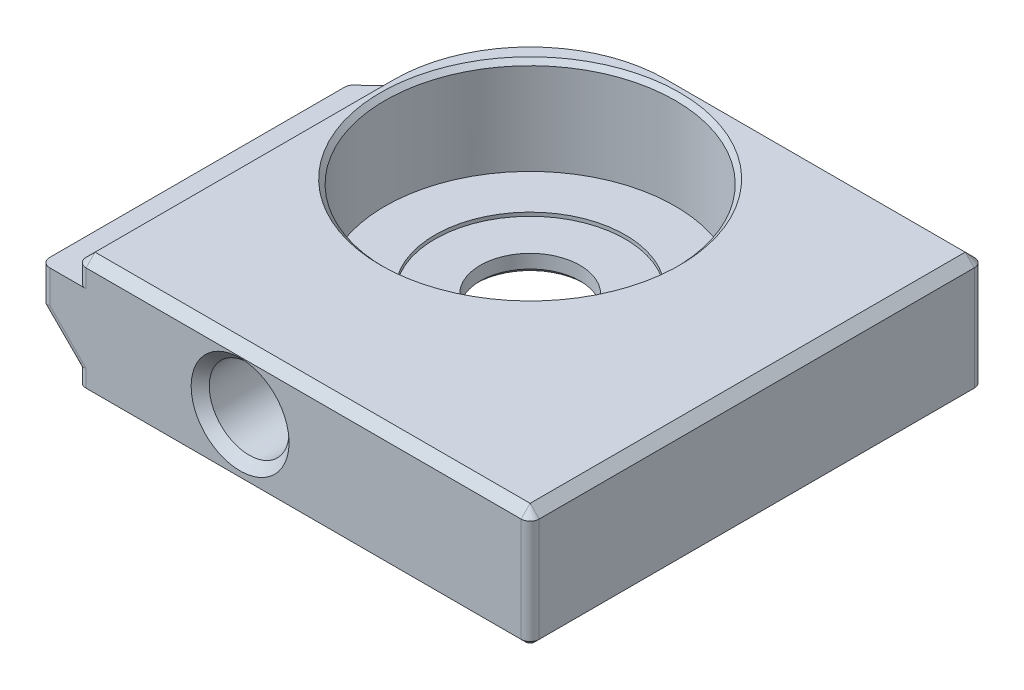
ISO-10303-21;
HEADER;
FILE_DESCRIPTION(('STEP AP214'),'2;1');
FILE_NAME('part.step','',(''),(''),'','','');
FILE_SCHEMA(('AUTOMOTIVE_DESIGN { 1 0 10303 214 1 1 1 1 }'));
ENDSEC;
DATA;
#1=APPLICATION_CONTEXT('core data for automotive mechanical design processes');
#2=APPLICATION_PROTOCOL_DEFINITION('international standard','automotive_design',2000,#1);
#3=PRODUCT_CONTEXT('',#1,'mechanical');
#4=PRODUCT('Part','Part','',(#3));
#5=PRODUCT_RELATED_PRODUCT_CATEGORY('part','',(#4));
#6=PRODUCT_DEFINITION_FORMATION('','',#4);
#7=PRODUCT_DEFINITION_CONTEXT('part definition',#1,'design');
#8=PRODUCT_DEFINITION('design','',#6,#7);
#9=PRODUCT_DEFINITION_SHAPE('','',#8);
#10=(LENGTH_UNIT() NAMED_UNIT(*) SI_UNIT(.MILLI.,.METRE.));
#11=(NAMED_UNIT(*) PLANE_ANGLE_UNIT() SI_UNIT($,.RADIAN.));
#12=(NAMED_UNIT(*) SI_UNIT($,.STERADIAN.) SOLID_ANGLE_UNIT());
#13=UNCERTAINTY_MEASURE_WITH_UNIT(LENGTH_MEASURE(1.E-05),#10,'distance_accuracy_value','');
#14=(GEOMETRIC_REPRESENTATION_CONTEXT(3) GLOBAL_UNCERTAINTY_ASSIGNED_CONTEXT((#13)) GLOBAL_UNIT_ASSIGNED_CONTEXT((#10,
#11,#12)) REPRESENTATION_CONTEXT('',''));
#15=CARTESIAN_POINT('',(0.,0.,0.));
#16=DIRECTION('',(0.,0.,1.));
#17=DIRECTION('',(1.,0.,0.));
#18=AXIS2_PLACEMENT_3D('',#15,#16,#17);
#19=CARTESIAN_POINT('',(-3.49999999999991,1.,-3.5));
#20=DIRECTION('',(0.,1.,0.));
#21=DIRECTION('',(0.,0.,1.));
#22=AXIS2_PLACEMENT_3D('',#19,#20,#21);
#23=PLANE('',#22);
#24=CARTESIAN_POINT('',(-3.49999999999991,1.,-3.5));
#25=DIRECTION('',(0.,1.,0.));
#26=DIRECTION('',(0.,0.,1.));
#27=AXIS2_PLACEMENT_3D('',#24,#25,#26);
#28=CIRCLE('',#27,2.75);
#29=CARTESIAN_POINT('',(-3.49999999999991,1.,-0.750000000000002));
#30=VERTEX_POINT('',#29);
#31=EDGE_CURVE('E50896',#30,#30,#28,.T.);
#32=ORIENTED_EDGE('',*,*,#31,.F.);
#33=EDGE_LOOP('',(#32));
#34=FACE_BOUND('',#33,.T.);
#35=CARTESIAN_POINT('',(-3.49999999999991,1.,-3.5));
#36=DIRECTION('',(0.,1.,0.));
#37=DIRECTION('',(0.,0.,1.));
#38=AXIS2_PLACEMENT_3D('',#35,#36,#37);
#39=CIRCLE('',#38,5.25);
#40=CARTESIAN_POINT('',(-3.49999999999991,1.,1.75));
#41=VERTEX_POINT('',#40);
#42=EDGE_CURVE('E50918',#41,#41,#39,.F.);
#43=ORIENTED_EDGE('',*,*,#42,.F.);
#44=EDGE_LOOP('',(#43));
#45=FACE_BOUND('',#44,.T.);
#46=ADVANCED_FACE('F50701',(#34,#45),#23,.T.);
#47=CARTESIAN_POINT('',(-12.5,6.5,12.5));
#48=DIRECTION('',(1.,0.,0.));
#49=DIRECTION('',(0.,0.,-1.));
#50=AXIS2_PLACEMENT_3D('',#47,#48,#49);
#51=PLANE('',#50);
#52=DIRECTION('',(0.,-1.,0.));
#53=VECTOR('',#52,1.);
#54=CARTESIAN_POINT('',(-12.5,6.5,-4.5));
#55=LINE('',#54,#53);
#56=CARTESIAN_POINT('',(-12.5,1.,-4.5));
#57=VERTEX_POINT('',#56);
#58=CARTESIAN_POINT('',(-12.5,0.249999999999997,-4.5));
#59=VERTEX_POINT('',#58);
#60=EDGE_CURVE('E50869',#57,#59,#55,.T.);
#61=ORIENTED_EDGE('',*,*,#60,.T.);
#62=DIRECTION('',(0.,0.,1.));
#63=VECTOR('',#62,1.);
#64=CARTESIAN_POINT('',(-12.5,0.249999999999997,12.));
#65=LINE('',#64,#63);
#66=CARTESIAN_POINT('',(-12.5,0.249999999999997,12.));
#67=VERTEX_POINT('',#66);
#68=EDGE_CURVE('E51057',#59,#67,#65,.T.);
#69=ORIENTED_EDGE('',*,*,#68,.T.);
#70=DIRECTION('',(0.,-1.,0.));
#71=VECTOR('',#70,1.);
#72=CARTESIAN_POINT('',(-12.5,6.5,12.));
#73=LINE('',#72,#71);
#74=CARTESIAN_POINT('',(-12.5,1.,12.));
#75=VERTEX_POINT('',#74);
#76=EDGE_CURVE('E50947',#67,#75,#73,.F.);
#77=ORIENTED_EDGE('',*,*,#76,.T.);
#78=DIRECTION('',(0.,0.,1.));
#79=VECTOR('',#78,1.);
#80=CARTESIAN_POINT('',(-12.5,1.,-4.5));
#81=LINE('',#80,#79);
#82=EDGE_CURVE('E50902',#57,#75,#81,.T.);
#83=ORIENTED_EDGE('',*,*,#82,.F.);
#84=EDGE_LOOP('',(#61,#69,#77,#83));
#85=FACE_BOUND('',#84,.T.);
#86=ADVANCED_FACE('F51159',(#85),#51,.F.);
#87=CARTESIAN_POINT('',(12.5,6.5,12.5));
#88=DIRECTION('',(-1.,0.,0.));
#89=DIRECTION('',(0.,0.,1.));
#90=AXIS2_PLACEMENT_3D('',#87,#88,#89);
#91=PLANE('',#90);
#92=DIRECTION('',(0.,-1.,0.));
#93=VECTOR('',#92,1.);
#94=CARTESIAN_POINT('',(12.5,6.5,12.));
#95=LINE('',#94,#93);
#96=CARTESIAN_POINT('',(12.5,6.,12.));
#97=VERTEX_POINT('',#96);
#98=CARTESIAN_POINT('',(12.5,0.249999999999997,12.));
#99=VERTEX_POINT('',#98);
#100=EDGE_CURVE('E50953',#97,#99,#95,.T.);
#101=ORIENTED_EDGE('',*,*,#100,.T.);
#102=DIRECTION('',(0.,0.,-1.));
#103=VECTOR('',#102,1.);
#104=CARTESIAN_POINT('',(12.5,0.249999999999997,-12.));
#105=LINE('',#104,#103);
#106=CARTESIAN_POINT('',(12.5,0.249999999999997,-12.));
#107=VERTEX_POINT('',#106);
#108=EDGE_CURVE('E50726',#99,#107,#105,.T.);
#109=ORIENTED_EDGE('',*,*,#108,.T.);
#110=DIRECTION('',(0.,-1.,0.));
#111=VECTOR('',#110,1.);
#112=CARTESIAN_POINT('',(12.5,6.5,-12.));
#113=LINE('',#112,#111);
#114=CARTESIAN_POINT('',(12.5,6.,-12.));
#115=VERTEX_POINT('',#114);
#116=EDGE_CURVE('E50955',#107,#115,#113,.F.);
#117=ORIENTED_EDGE('',*,*,#116,.T.);
#118=DIRECTION('',(0.,0.,1.));
#119=VECTOR('',#118,1.);
#120=CARTESIAN_POINT('',(12.5,6.,12.5));
#121=LINE('',#120,#119);
#122=EDGE_CURVE('E50989',#115,#97,#121,.T.);
#123=ORIENTED_EDGE('',*,*,#122,.T.);
#124=EDGE_LOOP('',(#101,#109,#117,#123));
#125=FACE_BOUND('',#124,.T.);
#126=ADVANCED_FACE('F51137',(#125),#91,.F.);
#127=CARTESIAN_POINT('',(-12.5,6.5,-12.5));
#128=DIRECTION('',(0.,0.,1.));
#129=DIRECTION('',(1.,0.,0.));
#130=AXIS2_PLACEMENT_3D('',#127,#128,#129);
#131=PLANE('',#130);
#132=DIRECTION('',(0.,-1.,0.));
#133=VECTOR('',#132,1.);
#134=CARTESIAN_POINT('',(12.,6.5,-12.5));
#135=LINE('',#134,#133);
#136=CARTESIAN_POINT('',(12.,6.,-12.5));
#137=VERTEX_POINT('',#136);
#138=CARTESIAN_POINT('',(12.,0.249999999999997,-12.5));
#139=VERTEX_POINT('',#138);
#140=EDGE_CURVE('E50951',#137,#139,#135,.T.);
#141=ORIENTED_EDGE('',*,*,#140,.T.);
#142=DIRECTION('',(-1.,0.,0.));
#143=VECTOR('',#142,1.);
#144=CARTESIAN_POINT('',(-4.5,0.249999999999997,-12.5));
#145=LINE('',#144,#143);
#146=CARTESIAN_POINT('',(-4.5,0.249999999999997,-12.5));
#147=VERTEX_POINT('',#146);
#148=EDGE_CURVE('E12',#139,#147,#145,.T.);
#149=ORIENTED_EDGE('',*,*,#148,.T.);
#150=DIRECTION('',(0.,-1.,0.));
#151=VECTOR('',#150,1.);
#152=CARTESIAN_POINT('',(-4.5,6.5,-12.5));
#153=LINE('',#152,#151);
#154=CARTESIAN_POINT('',(-4.5,6.,-12.5));
#155=VERTEX_POINT('',#154);
#156=EDGE_CURVE('E50907',#147,#155,#153,.F.);
#157=ORIENTED_EDGE('',*,*,#156,.T.);
#158=DIRECTION('',(1.,0.,0.));
#159=VECTOR('',#158,1.);
#160=CARTESIAN_POINT('',(-12.5,6.,-12.5));
#161=LINE('',#160,#159);
#162=EDGE_CURVE('E50999',#155,#137,#161,.T.);
#163=ORIENTED_EDGE('',*,*,#162,.T.);
#164=EDGE_LOOP('',(#141,#149,#157,#163));
#165=FACE_BOUND('',#164,.T.);
#166=ADVANCED_FACE('F51099',(#165),#131,.F.);
#167=DIRECTION('',(0.,-1.,0.));
#168=VECTOR('',#167,1.);
#169=CARTESIAN_POINT('',(-12.5,6.5,12.));
#170=LINE('',#169,#168);
#171=CARTESIAN_POINT('',(-12.5,5.,12.));
#172=VERTEX_POINT('',#171);
#173=CARTESIAN_POINT('',(-12.5,6.,12.));
#174=VERTEX_POINT('',#173);
#175=EDGE_CURVE('E50949',#172,#174,#170,.F.);
#176=ORIENTED_EDGE('',*,*,#175,.T.);
#177=DIRECTION('',(0.,0.,-1.));
#178=VECTOR('',#177,1.);
#179=CARTESIAN_POINT('',(-12.5,6.,12.5));
#180=LINE('',#179,#178);
#181=CARTESIAN_POINT('',(-12.5,6.,-4.5));
#182=VERTEX_POINT('',#181);
#183=EDGE_CURVE('E50864',#174,#182,#180,.T.);
#184=ORIENTED_EDGE('',*,*,#183,.T.);
#185=CARTESIAN_POINT('',(-12.5,5.,-4.5));
#186=VERTEX_POINT('',#185);
#187=EDGE_CURVE('E50856',#182,#186,#55,.T.);
#188=ORIENTED_EDGE('',*,*,#187,.T.);
#189=DIRECTION('',(0.,0.,1.));
#190=VECTOR('',#189,1.);
#191=CARTESIAN_POINT('',(-12.5,5.,-4.5));
#192=LINE('',#191,#190);
#193=EDGE_CURVE('E50861',#186,#172,#192,.T.);
#194=ORIENTED_EDGE('',*,*,#193,.T.);
#195=EDGE_LOOP('',(#176,#184,#188,#194));
#196=FACE_BOUND('',#195,.T.);
#197=ADVANCED_FACE('F50859',(#196),#51,.F.);
#198=CARTESIAN_POINT('',(-12.5,6.5,12.5));
#199=DIRECTION('',(0.,0.,-1.));
#200=DIRECTION('',(-1.,0.,0.));
#201=AXIS2_PLACEMENT_3D('',#198,#199,#200);
#202=PLANE('',#201);
#203=CARTESIAN_POINT('',(-3.5,3.25,12.5));
#204=DIRECTION('',(0.,0.,-1.));
#205=DIRECTION('',(-1.,0.,0.));
#206=AXIS2_PLACEMENT_3D('',#203,#204,#205);
#207=CIRCLE('',#206,2.70000000000001);
#208=CARTESIAN_POINT('',(-6.20000000000001,3.25,12.5));
#209=VERTEX_POINT('',#208);
#210=EDGE_CURVE('E50973',#209,#209,#207,.T.);
#211=ORIENTED_EDGE('',*,*,#210,.T.);
#212=EDGE_LOOP('',(#211));
#213=FACE_BOUND('',#212,.T.);
#214=DIRECTION('',(0.,-1.,0.));
#215=VECTOR('',#214,1.);
#216=CARTESIAN_POINT('',(-12.,6.5,12.5));
#217=LINE('',#216,#215);
#218=CARTESIAN_POINT('',(-12.,1.20710678118655,12.5));
#219=VERTEX_POINT('',#218);
#220=CARTESIAN_POINT('',(-12.,0.249999999999997,12.5));
#221=VERTEX_POINT('',#220);
#222=EDGE_CURVE('E50944',#219,#221,#217,.T.);
#223=ORIENTED_EDGE('',*,*,#222,.T.);
#224=DIRECTION('',(1.,0.,0.));
#225=VECTOR('',#224,1.);
#226=CARTESIAN_POINT('',(12.,0.249999999999997,12.5));
#227=LINE('',#226,#225);
#228=CARTESIAN_POINT('',(12.,0.249999999999997,12.5));
#229=VERTEX_POINT('',#228);
#230=EDGE_CURVE('E51066',#221,#229,#227,.T.);
#231=ORIENTED_EDGE('',*,*,#230,.T.);
#232=DIRECTION('',(0.,-1.,0.));
#233=VECTOR('',#232,1.);
#234=CARTESIAN_POINT('',(12.,6.5,12.5));
#235=LINE('',#234,#233);
#236=CARTESIAN_POINT('',(12.,6.,12.5));
#237=VERTEX_POINT('',#236);
#238=EDGE_CURVE('E50936',#229,#237,#235,.F.);
#239=ORIENTED_EDGE('',*,*,#238,.T.);
#240=DIRECTION('',(-1.,0.,0.));
#241=VECTOR('',#240,1.);
#242=CARTESIAN_POINT('',(-12.5,6.,12.5));
#243=LINE('',#242,#241);
#244=CARTESIAN_POINT('',(-12.,6.,12.5));
#245=VERTEX_POINT('',#244);
#246=EDGE_CURVE('E50970',#237,#245,#243,.T.);
#247=ORIENTED_EDGE('',*,*,#246,.T.);
#248=DIRECTION('',(0.,-1.,0.));
#249=VECTOR('',#248,1.);
#250=CARTESIAN_POINT('',(-12.,6.5,12.5));
#251=LINE('',#250,#249);
#252=CARTESIAN_POINT('',(-12.,5.,12.5));
#253=VERTEX_POINT('',#252);
#254=EDGE_CURVE('E50938',#245,#253,#251,.T.);
#255=ORIENTED_EDGE('',*,*,#254,.T.);
#256=DIRECTION('',(-1.,0.,0.));
#257=VECTOR('',#256,1.);
#258=CARTESIAN_POINT('',(-14.5,5.,12.5));
#259=LINE('',#258,#257);
#260=CARTESIAN_POINT('',(-14.,5.,12.5));
#261=VERTEX_POINT('',#260);
#262=EDGE_CURVE('E50889',#253,#261,#259,.T.);
#263=ORIENTED_EDGE('',*,*,#262,.T.);
#264=DIRECTION('',(0.,-1.,0.));
#265=VECTOR('',#264,1.);
#266=CARTESIAN_POINT('',(-14.,3.00000000000002,12.5));
#267=LINE('',#266,#265);
#268=CARTESIAN_POINT('',(-14.,3.20710678118657,12.5));
#269=VERTEX_POINT('',#268);
#270=EDGE_CURVE('E50940',#261,#269,#267,.T.);
#271=ORIENTED_EDGE('',*,*,#270,.T.);
#272=DIRECTION('',(0.707106781186544,-0.707106781186551,0.));
#273=VECTOR('',#272,1.);
#274=CARTESIAN_POINT('',(-12.1464466094067,1.35355339059327,12.5));
#275=LINE('',#274,#273);
#276=EDGE_CURVE('E50942',#269,#219,#275,.T.);
#277=ORIENTED_EDGE('',*,*,#276,.T.);
#278=EDGE_LOOP('',(#223,#231,#239,#247,#255,#263,#271,#277));
#279=FACE_BOUND('',#278,.T.);
#280=ADVANCED_FACE('F51185',(#213,#279),#202,.F.);
#281=CARTESIAN_POINT('',(0.,6.5,0.));
#282=DIRECTION('',(0.,-1.,0.));
#283=DIRECTION('',(0.,0.,-1.));
#284=AXIS2_PLACEMENT_3D('',#281,#282,#283);
#285=PLANE('',#284);
#286=CARTESIAN_POINT('',(-3.49999999999991,6.5,-3.5));
#287=DIRECTION('',(0.,-1.,0.));
#288=DIRECTION('',(0.,0.,-1.));
#289=AXIS2_PLACEMENT_3D('',#286,#287,#288);
#290=CIRCLE('',#289,8.25);
#291=CARTESIAN_POINT('',(-3.49999999999991,6.5,-11.75));
#292=VERTEX_POINT('',#291);
#293=EDGE_CURVE('E51030',#292,#292,#290,.T.);
#294=ORIENTED_EDGE('',*,*,#293,.T.);
#295=EDGE_LOOP('',(#294));
#296=FACE_BOUND('',#295,.T.);
#297=DIRECTION('',(1.,0.,0.));
#298=VECTOR('',#297,1.);
#299=CARTESIAN_POINT('',(0.,6.5,12.));
#300=LINE('',#299,#298);
#301=CARTESIAN_POINT('',(-12.,6.5,12.));
#302=VERTEX_POINT('',#301);
#303=CARTESIAN_POINT('',(12.,6.5,12.));
#304=VERTEX_POINT('',#303);
#305=EDGE_CURVE('E50982',#302,#304,#300,.T.);
#306=ORIENTED_EDGE('',*,*,#305,.T.);
#307=DIRECTION('',(0.,0.,-1.));
#308=VECTOR('',#307,1.);
#309=CARTESIAN_POINT('',(12.,6.5,0.));
#310=LINE('',#309,#308);
#311=CARTESIAN_POINT('',(12.,6.5,-12.));
#312=VERTEX_POINT('',#311);
#313=EDGE_CURVE('E50985',#304,#312,#310,.T.);
#314=ORIENTED_EDGE('',*,*,#313,.T.);
#315=DIRECTION('',(-1.,0.,0.));
#316=VECTOR('',#315,1.);
#317=CARTESIAN_POINT('',(0.,6.5,-12.));
#318=LINE('',#317,#316);
#319=CARTESIAN_POINT('',(-4.5,6.5,-12.));
#320=VERTEX_POINT('',#319);
#321=EDGE_CURVE('E50980',#312,#320,#318,.T.);
#322=ORIENTED_EDGE('',*,*,#321,.T.);
#323=CARTESIAN_POINT('',(-4.5,6.5,-4.5));
#324=DIRECTION('',(0.,-1.,0.));
#325=DIRECTION('',(0.,0.,-1.));
#326=AXIS2_PLACEMENT_3D('',#323,#324,#325);
#327=CIRCLE('',#326,7.5);
#328=CARTESIAN_POINT('',(-12.,6.5,-4.5));
#329=VERTEX_POINT('',#328);
#330=EDGE_CURVE('E50978',#320,#329,#327,.F.);
#331=ORIENTED_EDGE('',*,*,#330,.T.);
#332=DIRECTION('',(0.,0.,1.));
#333=VECTOR('',#332,1.);
#334=CARTESIAN_POINT('',(-12.,6.5,0.));
#335=LINE('',#334,#333);
#336=EDGE_CURVE('E50976',#329,#302,#335,.T.);
#337=ORIENTED_EDGE('',*,*,#336,.T.);
#338=EDGE_LOOP('',(#306,#314,#322,#331,#337));
#339=FACE_BOUND('',#338,.T.);
#340=ADVANCED_FACE('F51123',(#296,#339),#285,.F.);
#341=CARTESIAN_POINT('',(0.,0.,0.));
#342=DIRECTION('',(0.,-1.,0.));
#343=DIRECTION('',(0.,0.,-1.));
#344=AXIS2_PLACEMENT_3D('',#341,#342,#343);
#345=PLANE('',#344);
#346=CARTESIAN_POINT('',(-3.49999999999991,0.,-3.5));
#347=DIRECTION('',(0.,-1.,0.));
#348=DIRECTION('',(0.,0.,-1.));
#349=AXIS2_PLACEMENT_3D('',#346,#347,#348);
#350=CIRCLE('',#349,2.99999999999999);
#351=CARTESIAN_POINT('',(-3.49999999999991,0.,-6.49999999999999));
#352=VERTEX_POINT('',#351);
#353=EDGE_CURVE('E51049',#352,#352,#350,.F.);
#354=ORIENTED_EDGE('',*,*,#353,.T.);
#355=EDGE_LOOP('',(#354));
#356=FACE_BOUND('',#355,.T.);
#357=CARTESIAN_POINT('',(-12.,0.,12.));
#358=DIRECTION('',(0.,-1.,0.));
#359=DIRECTION('',(0.,0.,-1.));
#360=AXIS2_PLACEMENT_3D('',#357,#358,#359);
#361=CIRCLE('',#360,0.25);
#362=CARTESIAN_POINT('',(-12.,0.,12.25));
#363=VERTEX_POINT('',#362);
#364=CARTESIAN_POINT('',(-12.25,0.,12.));
#365=VERTEX_POINT('',#364);
#366=EDGE_CURVE('E51045',#363,#365,#361,.T.);
#367=ORIENTED_EDGE('',*,*,#366,.T.);
#368=DIRECTION('',(0.,0.,-1.));
#369=VECTOR('',#368,1.);
#370=CARTESIAN_POINT('',(-12.25,0.,-4.5));
#371=LINE('',#370,#369);
#372=CARTESIAN_POINT('',(-12.25,0.,-6.48431348329845));
#373=VERTEX_POINT('',#372);
#374=EDGE_CURVE('E51047',#365,#373,#371,.T.);
#375=ORIENTED_EDGE('',*,*,#374,.T.);
#376=CARTESIAN_POINT('',(-4.5,0.,-4.5));
#377=DIRECTION('',(0.,-1.,0.));
#378=DIRECTION('',(0.,0.,-1.));
#379=AXIS2_PLACEMENT_3D('',#376,#377,#378);
#380=CIRCLE('',#379,8.);
#381=CARTESIAN_POINT('',(-6.48431348329843,0.,-12.25));
#382=VERTEX_POINT('',#381);
#383=EDGE_CURVE('E50868',#373,#382,#380,.T.);
#384=ORIENTED_EDGE('',*,*,#383,.T.);
#385=DIRECTION('',(1.,0.,0.));
#386=VECTOR('',#385,1.);
#387=CARTESIAN_POINT('',(12.,0.,-12.25));
#388=LINE('',#387,#386);
#389=CARTESIAN_POINT('',(12.,0.,-12.25));
#390=VERTEX_POINT('',#389);
#391=EDGE_CURVE('E51036',#382,#390,#388,.T.);
#392=ORIENTED_EDGE('',*,*,#391,.T.);
#393=CARTESIAN_POINT('',(12.,0.,-12.));
#394=DIRECTION('',(0.,-1.,0.));
#395=DIRECTION('',(0.,0.,-1.));
#396=AXIS2_PLACEMENT_3D('',#393,#394,#395);
#397=CIRCLE('',#396,0.25);
#398=CARTESIAN_POINT('',(12.25,0.,-12.));
#399=VERTEX_POINT('',#398);
#400=EDGE_CURVE('E51034',#390,#399,#397,.T.);
#401=ORIENTED_EDGE('',*,*,#400,.T.);
#402=DIRECTION('',(0.,0.,1.));
#403=VECTOR('',#402,1.);
#404=CARTESIAN_POINT('',(12.25,0.,12.));
#405=LINE('',#404,#403);
#406=CARTESIAN_POINT('',(12.25,0.,12.));
#407=VERTEX_POINT('',#406);
#408=EDGE_CURVE('E51038',#399,#407,#405,.T.);
#409=ORIENTED_EDGE('',*,*,#408,.T.);
#410=CARTESIAN_POINT('',(12.,0.,12.));
#411=DIRECTION('',(0.,-1.,0.));
#412=DIRECTION('',(0.,0.,-1.));
#413=AXIS2_PLACEMENT_3D('',#410,#411,#412);
#414=CIRCLE('',#413,0.25);
#415=CARTESIAN_POINT('',(12.,0.,12.25));
#416=VERTEX_POINT('',#415);
#417=EDGE_CURVE('E51040',#407,#416,#414,.T.);
#418=ORIENTED_EDGE('',*,*,#417,.T.);
#419=DIRECTION('',(-1.,0.,0.));
#420=VECTOR('',#419,1.);
#421=CARTESIAN_POINT('',(-12.,0.,12.25));
#422=LINE('',#421,#420);
#423=EDGE_CURVE('E51042',#416,#363,#422,.T.);
#424=ORIENTED_EDGE('',*,*,#423,.T.);
#425=EDGE_LOOP('',(#367,#375,#384,#392,#401,#409,#418,#424));
#426=FACE_BOUND('',#425,.T.);
#427=ADVANCED_FACE('F51146',(#356,#426),#345,.T.);
#428=CARTESIAN_POINT('',(-3.49999999999991,1.,-3.5));
#429=DIRECTION('',(0.,1.,0.));
#430=DIRECTION('',(0.,0.,1.));
#431=AXIS2_PLACEMENT_3D('',#428,#429,#430);
#432=CYLINDRICAL_SURFACE('',#431,8.00000000000001);
#433=CARTESIAN_POINT('',(-3.49999999999991,6.25000000000001,-3.5));
#434=DIRECTION('',(0.,-1.,0.));
#435=DIRECTION('',(0.,0.,-1.));
#436=AXIS2_PLACEMENT_3D('',#433,#434,#435);
#437=CIRCLE('',#436,8.00000000000001);
#438=CARTESIAN_POINT('',(-3.49999999999991,6.25000000000001,-11.5));
#439=VERTEX_POINT('',#438);
#440=EDGE_CURVE('E51006',#439,#439,#437,.F.);
#441=ORIENTED_EDGE('',*,*,#440,.T.);
#442=EDGE_LOOP('',(#441));
#443=FACE_BOUND('',#442,.T.);
#444=CARTESIAN_POINT('',(-3.49999999999991,1.2,-3.5));
#445=DIRECTION('',(0.,1.,0.));
#446=DIRECTION('',(0.,0.,1.));
#447=AXIS2_PLACEMENT_3D('',#444,#445,#446);
#448=CIRCLE('',#447,8.00000000000001);
#449=CARTESIAN_POINT('',(-3.49999999999991,1.2,4.50000000000001));
#450=VERTEX_POINT('',#449);
#451=EDGE_CURVE('E51640',#450,#450,#448,.T.);
#452=ORIENTED_EDGE('',*,*,#451,.F.);
#453=EDGE_LOOP('',(#452));
#454=FACE_BOUND('',#453,.T.);
#455=ADVANCED_FACE('F51220',(#443,#454),#432,.F.);
#456=CARTESIAN_POINT('',(-4.5,6.5,-4.5));
#457=DIRECTION('',(0.,-1.,0.));
#458=DIRECTION('',(0.,0.,-1.));
#459=AXIS2_PLACEMENT_3D('',#456,#457,#458);
#460=CYLINDRICAL_SURFACE('',#459,8.);
#461=ORIENTED_EDGE('',*,*,#383,.F.);
#462=CARTESIAN_POINT('',(-4.5,-7.74999999999989,-4.5));
#463=DIRECTION('',(-0.707106781186543,-0.707106781186552,0.));
#464=DIRECTION('',(0.707106781186552,-0.707106781186543,0.));
#465=AXIS2_PLACEMENT_3D('',#462,#463,#464);
#466=ELLIPSE('',#465,11.3137084989847,8.);
#467=EDGE_CURVE('E51062',#373,#59,#466,.F.);
#468=ORIENTED_EDGE('',*,*,#467,.T.);
#469=ORIENTED_EDGE('',*,*,#60,.F.);
#470=CARTESIAN_POINT('',(-4.5,-7.00000000000008,-4.5));
#471=DIRECTION('',(-0.707106781186551,-0.707106781186544,0.));
#472=DIRECTION('',(0.707106781186544,-0.707106781186551,0.));
#473=AXIS2_PLACEMENT_3D('',#470,#471,#472);
#474=ELLIPSE('',#473,11.3137084989848,8.);
#475=CARTESIAN_POINT('',(-11.7,0.199999999999995,-7.98711915483253));
#476=VERTEX_POINT('',#475);
#477=EDGE_CURVE('E50910',#57,#476,#474,.T.);
#478=ORIENTED_EDGE('',*,*,#477,.T.);
#479=DIRECTION('',(0.,-1.,0.));
#480=VECTOR('',#479,1.);
#481=CARTESIAN_POINT('',(-11.7,6.5,-7.98711915483253));
#482=LINE('',#481,#480);
#483=CARTESIAN_POINT('',(-11.7,5.,-7.98711915483253));
#484=VERTEX_POINT('',#483);
#485=EDGE_CURVE('E50878',#476,#484,#482,.F.);
#486=ORIENTED_EDGE('',*,*,#485,.T.);
#487=CARTESIAN_POINT('',(-4.5,5.,-4.5));
#488=DIRECTION('',(0.,1.,0.));
#489=DIRECTION('',(0.,0.,1.));
#490=AXIS2_PLACEMENT_3D('',#487,#488,#489);
#491=CIRCLE('',#490,8.);
#492=EDGE_CURVE('E50873',#484,#186,#491,.T.);
#493=ORIENTED_EDGE('',*,*,#492,.T.);
#494=ORIENTED_EDGE('',*,*,#187,.F.);
#495=CARTESIAN_POINT('',(-4.5,6.,-4.5));
#496=DIRECTION('',(0.,-1.,0.));
#497=DIRECTION('',(0.,0.,-1.));
#498=AXIS2_PLACEMENT_3D('',#495,#496,#497);
#499=CIRCLE('',#498,8.);
#500=EDGE_CURVE('E51001',#182,#155,#499,.T.);
#501=ORIENTED_EDGE('',*,*,#500,.T.);
#502=ORIENTED_EDGE('',*,*,#156,.F.);
#503=CARTESIAN_POINT('',(-4.5,-7.7499999999999,-4.5));
#504=DIRECTION('',(0.,-0.707106781186552,-0.707106781186543));
#505=DIRECTION('',(0.,-0.707106781186543,0.707106781186552));
#506=AXIS2_PLACEMENT_3D('',#503,#504,#505);
#507=ELLIPSE('',#506,11.3137084989847,8.);
#508=EDGE_CURVE('E51060',#147,#382,#507,.F.);
#509=ORIENTED_EDGE('',*,*,#508,.T.);
#510=EDGE_LOOP('',(#461,#468,#469,#478,#486,#493,#494,#501,#502,#509));
#511=FACE_BOUND('',#510,.T.);
#512=ADVANCED_FACE('F50875',(#511),#460,.T.);
#513=CARTESIAN_POINT('',(-3.5,3.25,5.));
#514=DIRECTION('',(0.,0.,1.));
#515=DIRECTION('',(1.,0.,0.));
#516=AXIS2_PLACEMENT_3D('',#513,#514,#515);
#517=CYLINDRICAL_SURFACE('',#516,2.2);
#518=CARTESIAN_POINT('',(-3.5,3.25,12.));
#519=DIRECTION('',(0.,0.,-1.));
#520=DIRECTION('',(-1.,0.,0.));
#521=AXIS2_PLACEMENT_3D('',#518,#519,#520);
#522=CIRCLE('',#521,2.2);
#523=CARTESIAN_POINT('',(-5.7,3.25,12.));
#524=VERTEX_POINT('',#523);
#525=EDGE_CURVE('E50958',#524,#524,#522,.F.);
#526=ORIENTED_EDGE('',*,*,#525,.T.);
#527=EDGE_LOOP('',(#526));
#528=FACE_BOUND('',#527,.T.);
#529=CARTESIAN_POINT('',(-3.5,3.25,5.));
#530=DIRECTION('',(0.,0.,1.));
#531=DIRECTION('',(1.,0.,0.));
#532=AXIS2_PLACEMENT_3D('',#529,#530,#531);
#533=CIRCLE('',#532,2.2);
#534=CARTESIAN_POINT('',(-1.3,3.25,5.));
#535=VERTEX_POINT('',#534);
#536=EDGE_CURVE('E50900',#535,#535,#533,.T.);
#537=ORIENTED_EDGE('',*,*,#536,.F.);
#538=EDGE_LOOP('',(#537));
#539=FACE_BOUND('',#538,.T.);
#540=ADVANCED_FACE('F51218',(#528,#539),#517,.F.);
#541=CARTESIAN_POINT('',(-3.5,3.25,5.));
#542=DIRECTION('',(0.,0.,1.));
#543=DIRECTION('',(1.,0.,0.));
#544=AXIS2_PLACEMENT_3D('',#541,#542,#543);
#545=PLANE('',#544);
#546=ORIENTED_EDGE('',*,*,#536,.T.);
#547=EDGE_LOOP('',(#546));
#548=FACE_BOUND('',#547,.T.);
#549=ADVANCED_FACE('F51559',(#548),#545,.T.);
#550=CARTESIAN_POINT('',(-12.5,1.,-4.5));
#551=DIRECTION('',(-0.707106781186551,-0.707106781186544,0.));
#552=DIRECTION('',(0.707106781186544,-0.707106781186551,0.));
#553=AXIS2_PLACEMENT_3D('',#550,#551,#552);
#554=PLANE('',#553);
#555=DIRECTION('',(0.,0.,1.));
#556=VECTOR('',#555,1.);
#557=CARTESIAN_POINT('',(-14.5,3.00000000000002,-4.5));
#558=LINE('',#557,#556);
#559=CARTESIAN_POINT('',(-14.5,3.00000000000002,-4.26146492581012));
#560=VERTEX_POINT('',#559);
#561=CARTESIAN_POINT('',(-14.5,3.00000000000002,12.));
#562=VERTEX_POINT('',#561);
#563=EDGE_CURVE('E50892',#560,#562,#558,.T.);
#564=ORIENTED_EDGE('',*,*,#563,.F.);
#565=CARTESIAN_POINT('',(-14.,2.50000000000002,-4.26146492581012));
#566=DIRECTION('',(-0.707106781186551,-0.707106781186544,0.));
#567=DIRECTION('',(0.707106781186544,-0.707106781186551,0.));
#568=AXIS2_PLACEMENT_3D('',#565,#566,#567);
#569=ELLIPSE('',#568,0.707106781186551,0.5);
#570=CARTESIAN_POINT('',(-14.3190476190476,2.81904761904764,-4.64644364831312));
#571=VERTEX_POINT('',#570);
#572=EDGE_CURVE('E50928',#560,#571,#569,.T.);
#573=ORIENTED_EDGE('',*,*,#572,.T.);
#574=CARTESIAN_POINT('',(-20.7,9.2000000000001,-12.3460180983732));
#575=DIRECTION('',(-0.707106781186551,-0.707106781186544,0.));
#576=DIRECTION('',(0.707106781186544,-0.707106781186551,0.));
#577=AXIS2_PLACEMENT_3D('',#574,#575,#576);
#578=ELLIPSE('',#577,14.142135623731,10.);
#579=EDGE_CURVE('E50916',#571,#476,#578,.F.);
#580=ORIENTED_EDGE('',*,*,#579,.T.);
#581=ORIENTED_EDGE('',*,*,#477,.F.);
#582=ORIENTED_EDGE('',*,*,#82,.T.);
#583=DIRECTION('',(0.707106781186544,-0.707106781186551,0.));
#584=VECTOR('',#583,1.);
#585=CARTESIAN_POINT('',(-14.5,3.00000000000002,12.));
#586=LINE('',#585,#584);
#587=EDGE_CURVE('E50926',#75,#562,#586,.F.);
#588=ORIENTED_EDGE('',*,*,#587,.T.);
#589=EDGE_LOOP('',(#564,#573,#580,#581,#582,#588));
#590=FACE_BOUND('',#589,.T.);
#591=ADVANCED_FACE('F51174',(#590),#554,.T.);
#592=CARTESIAN_POINT('',(-14.5,3.00000000000002,-4.5));
#593=DIRECTION('',(-1.,0.,0.));
#594=DIRECTION('',(0.,0.,1.));
#595=AXIS2_PLACEMENT_3D('',#592,#593,#594);
#596=PLANE('',#595);
#597=DIRECTION('',(0.,0.,1.));
#598=VECTOR('',#597,1.);
#599=CARTESIAN_POINT('',(-14.5,5.,-4.5));
#600=LINE('',#599,#598);
#601=CARTESIAN_POINT('',(-14.5,5.,-4.26146492581012));
#602=VERTEX_POINT('',#601);
#603=CARTESIAN_POINT('',(-14.5,5.,12.));
#604=VERTEX_POINT('',#603);
#605=EDGE_CURVE('E50888',#602,#604,#600,.T.);
#606=ORIENTED_EDGE('',*,*,#605,.F.);
#607=DIRECTION('',(0.,1.,0.));
#608=VECTOR('',#607,1.);
#609=CARTESIAN_POINT('',(-14.5,3.00000000000002,-4.26146492581012));
#610=LINE('',#609,#608);
#611=EDGE_CURVE('E50923',#602,#560,#610,.F.);
#612=ORIENTED_EDGE('',*,*,#611,.T.);
#613=ORIENTED_EDGE('',*,*,#563,.T.);
#614=DIRECTION('',(0.,-1.,0.));
#615=VECTOR('',#614,1.);
#616=CARTESIAN_POINT('',(-14.5,5.,12.));
#617=LINE('',#616,#615);
#618=EDGE_CURVE('E50921',#562,#604,#617,.F.);
#619=ORIENTED_EDGE('',*,*,#618,.T.);
#620=EDGE_LOOP('',(#606,#612,#613,#619));
#621=FACE_BOUND('',#620,.T.);
#622=ADVANCED_FACE('F51178',(#621),#596,.T.);
#623=CARTESIAN_POINT('',(-14.5,5.,-4.5));
#624=DIRECTION('',(0.,1.,0.));
#625=DIRECTION('',(0.,0.,1.));
#626=AXIS2_PLACEMENT_3D('',#623,#624,#625);
#627=PLANE('',#626);
#628=CARTESIAN_POINT('',(-20.7,5.,-12.3460180983732));
#629=DIRECTION('',(0.,1.,0.));
#630=DIRECTION('',(0.,0.,1.));
#631=AXIS2_PLACEMENT_3D('',#628,#629,#630);
#632=CIRCLE('',#631,10.);
#633=CARTESIAN_POINT('',(-14.3190476190476,5.,-4.64644364831312));
#634=VERTEX_POINT('',#633);
#635=EDGE_CURVE('E50882',#484,#634,#632,.F.);
#636=ORIENTED_EDGE('',*,*,#635,.T.);
#637=CARTESIAN_POINT('',(-14.,5.,-4.26146492581012));
#638=DIRECTION('',(0.,1.,0.));
#639=DIRECTION('',(0.,0.,1.));
#640=AXIS2_PLACEMENT_3D('',#637,#638,#639);
#641=CIRCLE('',#640,0.5);
#642=EDGE_CURVE('E50934',#634,#602,#641,.T.);
#643=ORIENTED_EDGE('',*,*,#642,.T.);
#644=ORIENTED_EDGE('',*,*,#605,.T.);
#645=CARTESIAN_POINT('',(-14.,5.,12.));
#646=DIRECTION('',(0.,1.,0.));
#647=DIRECTION('',(0.,0.,1.));
#648=AXIS2_PLACEMENT_3D('',#645,#646,#647);
#649=CIRCLE('',#648,0.5);
#650=EDGE_CURVE('E50932',#604,#261,#649,.T.);
#651=ORIENTED_EDGE('',*,*,#650,.T.);
#652=ORIENTED_EDGE('',*,*,#262,.F.);
#653=CARTESIAN_POINT('',(-12.,5.,12.));
#654=DIRECTION('',(0.,1.,0.));
#655=DIRECTION('',(0.,0.,1.));
#656=AXIS2_PLACEMENT_3D('',#653,#654,#655);
#657=CIRCLE('',#656,0.5);
#658=EDGE_CURVE('E50887',#253,#172,#657,.F.);
#659=ORIENTED_EDGE('',*,*,#658,.T.);
#660=ORIENTED_EDGE('',*,*,#193,.F.);
#661=ORIENTED_EDGE('',*,*,#492,.F.);
#662=EDGE_LOOP('',(#636,#643,#644,#651,#652,#659,#660,#661));
#663=FACE_BOUND('',#662,.T.);
#664=ADVANCED_FACE('F50884',(#663),#627,.T.);
#665=CARTESIAN_POINT('',(-20.7,0.,-12.3460180983732));
#666=DIRECTION('',(0.,-1.,0.));
#667=DIRECTION('',(0.,0.,-1.));
#668=AXIS2_PLACEMENT_3D('',#665,#666,#667);
#669=CYLINDRICAL_SURFACE('',#668,10.);
#670=ORIENTED_EDGE('',*,*,#579,.F.);
#671=DIRECTION('',(0.,-1.,0.));
#672=VECTOR('',#671,1.);
#673=CARTESIAN_POINT('',(-14.3190476190476,0.,-4.64644364831312));
#674=LINE('',#673,#672);
#675=EDGE_CURVE('E50930',#571,#634,#674,.F.);
#676=ORIENTED_EDGE('',*,*,#675,.T.);
#677=ORIENTED_EDGE('',*,*,#635,.F.);
#678=ORIENTED_EDGE('',*,*,#485,.F.);
#679=EDGE_LOOP('',(#670,#676,#677,#678));
#680=FACE_BOUND('',#679,.T.);
#681=ADVANCED_FACE('F51240',(#680),#669,.F.);
#682=CARTESIAN_POINT('',(-3.49999999999991,0.,-3.5));
#683=DIRECTION('',(0.,1.,0.));
#684=DIRECTION('',(0.,0.,1.));
#685=AXIS2_PLACEMENT_3D('',#682,#683,#684);
#686=CYLINDRICAL_SURFACE('',#685,2.75);
#687=CARTESIAN_POINT('',(-3.49999999999991,0.249999999999997,-3.5));
#688=DIRECTION('',(0.,-1.,0.));
#689=DIRECTION('',(0.,0.,-1.));
#690=AXIS2_PLACEMENT_3D('',#687,#688,#689);
#691=CIRCLE('',#690,2.75);
#692=CARTESIAN_POINT('',(-3.49999999999991,0.249999999999997,-6.25));
#693=VERTEX_POINT('',#692);
#694=EDGE_CURVE('E51053',#693,#693,#691,.T.);
#695=ORIENTED_EDGE('',*,*,#694,.T.);
#696=EDGE_LOOP('',(#695));
#697=FACE_BOUND('',#696,.T.);
#698=ORIENTED_EDGE('',*,*,#31,.T.);
#699=EDGE_LOOP('',(#698));
#700=FACE_BOUND('',#699,.T.);
#701=ADVANCED_FACE('F51243',(#697,#700),#686,.F.);
#702=CARTESIAN_POINT('',(-3.49999999999991,1.2,-3.5));
#703=DIRECTION('',(0.,1.,0.));
#704=DIRECTION('',(0.,0.,1.));
#705=AXIS2_PLACEMENT_3D('',#702,#703,#704);
#706=PLANE('',#705);
#707=ORIENTED_EDGE('',*,*,#451,.T.);
#708=EDGE_LOOP('',(#707));
#709=FACE_BOUND('',#708,.T.);
#710=CARTESIAN_POINT('',(-3.49999999999991,1.2,-3.5));
#711=DIRECTION('',(0.,1.,0.));
#712=DIRECTION('',(0.,0.,1.));
#713=AXIS2_PLACEMENT_3D('',#710,#711,#712);
#714=CIRCLE('',#713,5.25);
#715=CARTESIAN_POINT('',(-3.49999999999991,1.2,1.75));
#716=VERTEX_POINT('',#715);
#717=EDGE_CURVE('E50966',#716,#716,#714,.T.);
#718=ORIENTED_EDGE('',*,*,#717,.F.);
#719=EDGE_LOOP('',(#718));
#720=FACE_BOUND('',#719,.T.);
#721=ADVANCED_FACE('F51375',(#709,#720),#706,.T.);
#722=CARTESIAN_POINT('',(-3.49999999999991,1.2,-3.5));
#723=DIRECTION('',(0.,-1.,0.));
#724=DIRECTION('',(0.,0.,-1.));
#725=AXIS2_PLACEMENT_3D('',#722,#723,#724);
#726=CYLINDRICAL_SURFACE('',#725,5.25);
#727=ORIENTED_EDGE('',*,*,#717,.T.);
#728=EDGE_LOOP('',(#727));
#729=FACE_BOUND('',#728,.T.);
#730=ORIENTED_EDGE('',*,*,#42,.T.);
#731=EDGE_LOOP('',(#730));
#732=FACE_BOUND('',#731,.T.);
#733=ADVANCED_FACE('F51248',(#729,#732),#726,.F.);
#734=CARTESIAN_POINT('',(-14.,0.,-4.26146492581012));
#735=DIRECTION('',(0.,-1.,0.));
#736=DIRECTION('',(0.,0.,-1.));
#737=AXIS2_PLACEMENT_3D('',#734,#735,#736);
#738=CYLINDRICAL_SURFACE('',#737,0.5);
#739=ORIENTED_EDGE('',*,*,#642,.F.);
#740=ORIENTED_EDGE('',*,*,#675,.F.);
#741=ORIENTED_EDGE('',*,*,#572,.F.);
#742=ORIENTED_EDGE('',*,*,#611,.F.);
#743=EDGE_LOOP('',(#739,#740,#741,#742));
#744=FACE_BOUND('',#743,.T.);
#745=ADVANCED_FACE('F51245',(#744),#738,.T.);
#746=CARTESIAN_POINT('',(-14.,6.5,12.));
#747=DIRECTION('',(0.,1.,0.));
#748=DIRECTION('',(0.,0.,1.));
#749=AXIS2_PLACEMENT_3D('',#746,#747,#748);
#750=CYLINDRICAL_SURFACE('',#749,0.5);
#751=ORIENTED_EDGE('',*,*,#650,.F.);
#752=ORIENTED_EDGE('',*,*,#618,.F.);
#753=CARTESIAN_POINT('',(-14.,3.20710678118657,12.));
#754=DIRECTION('',(-0.382683432365087,0.923879532511288,0.));
#755=DIRECTION('',(0.923879532511288,0.382683432365087,0.));
#756=AXIS2_PLACEMENT_3D('',#753,#754,#755);
#757=ELLIPSE('',#756,0.541196100146196,0.5);
#758=EDGE_CURVE('E50962',#269,#562,#757,.F.);
#759=ORIENTED_EDGE('',*,*,#758,.F.);
#760=ORIENTED_EDGE('',*,*,#270,.F.);
#761=EDGE_LOOP('',(#751,#752,#759,#760));
#762=FACE_BOUND('',#761,.T.);
#763=ADVANCED_FACE('F51182',(#762),#750,.T.);
#764=CARTESIAN_POINT('',(-14.8964466094067,4.1035533905933,12.));
#765=DIRECTION('',(-0.707106781186544,0.707106781186551,0.));
#766=DIRECTION('',(-0.707106781186551,-0.707106781186544,0.));
#767=AXIS2_PLACEMENT_3D('',#764,#765,#766);
#768=CYLINDRICAL_SURFACE('',#767,0.5);
#769=ORIENTED_EDGE('',*,*,#758,.T.);
#770=ORIENTED_EDGE('',*,*,#587,.F.);
#771=CARTESIAN_POINT('',(-12.,1.20710678118655,12.));
#772=DIRECTION('',(0.382683432365087,-0.923879532511288,0.));
#773=DIRECTION('',(-0.923879532511288,-0.382683432365087,0.));
#774=AXIS2_PLACEMENT_3D('',#771,#772,#773);
#775=ELLIPSE('',#774,0.541196100146196,0.5);
#776=EDGE_CURVE('E50959',#219,#75,#775,.T.);
#777=ORIENTED_EDGE('',*,*,#776,.F.);
#778=ORIENTED_EDGE('',*,*,#276,.F.);
#779=EDGE_LOOP('',(#769,#770,#777,#778));
#780=FACE_BOUND('',#779,.T.);
#781=ADVANCED_FACE('F51169',(#780),#768,.T.);
#782=CARTESIAN_POINT('',(-12.,6.5,12.));
#783=DIRECTION('',(0.,-1.,0.));
#784=DIRECTION('',(0.,0.,-1.));
#785=AXIS2_PLACEMENT_3D('',#782,#783,#784);
#786=CYLINDRICAL_SURFACE('',#785,0.5);
#787=ORIENTED_EDGE('',*,*,#76,.F.);
#788=CARTESIAN_POINT('',(-12.,0.249999999999997,12.));
#789=DIRECTION('',(0.,-1.,0.));
#790=DIRECTION('',(0.,0.,-1.));
#791=AXIS2_PLACEMENT_3D('',#788,#789,#790);
#792=CIRCLE('',#791,0.5);
#793=EDGE_CURVE('E51064',#67,#221,#792,.F.);
#794=ORIENTED_EDGE('',*,*,#793,.T.);
#795=ORIENTED_EDGE('',*,*,#222,.F.);
#796=ORIENTED_EDGE('',*,*,#776,.T.);
#797=EDGE_LOOP('',(#787,#794,#795,#796));
#798=FACE_BOUND('',#797,.T.);
#799=ADVANCED_FACE('F51163',(#798),#786,.T.);
#800=CARTESIAN_POINT('',(-12.,6.5,12.));
#801=DIRECTION('',(0.,-1.,0.));
#802=DIRECTION('',(0.,0.,-1.));
#803=AXIS2_PLACEMENT_3D('',#800,#801,#802);
#804=CYLINDRICAL_SURFACE('',#803,0.5);
#805=ORIENTED_EDGE('',*,*,#254,.F.);
#806=CARTESIAN_POINT('',(-12.,6.,12.));
#807=DIRECTION('',(0.,-1.,0.));
#808=DIRECTION('',(0.,0.,-1.));
#809=AXIS2_PLACEMENT_3D('',#806,#807,#808);
#810=CIRCLE('',#809,0.5);
#811=EDGE_CURVE('E51003',#245,#174,#810,.T.);
#812=ORIENTED_EDGE('',*,*,#811,.T.);
#813=ORIENTED_EDGE('',*,*,#175,.F.);
#814=ORIENTED_EDGE('',*,*,#658,.F.);
#815=EDGE_LOOP('',(#805,#812,#813,#814));
#816=FACE_BOUND('',#815,.T.);
#817=ADVANCED_FACE('F51189',(#816),#804,.T.);
#818=CARTESIAN_POINT('',(12.,6.5,-12.));
#819=DIRECTION('',(0.,-1.,0.));
#820=DIRECTION('',(0.,0.,-1.));
#821=AXIS2_PLACEMENT_3D('',#818,#819,#820);
#822=CYLINDRICAL_SURFACE('',#821,0.5);
#823=ORIENTED_EDGE('',*,*,#116,.F.);
#824=CARTESIAN_POINT('',(12.,0.249999999999997,-12.));
#825=DIRECTION('',(0.,-1.,0.));
#826=DIRECTION('',(0.,0.,-1.));
#827=AXIS2_PLACEMENT_3D('',#824,#825,#826);
#828=CIRCLE('',#827,0.5);
#829=EDGE_CURVE('E50711',#107,#139,#828,.F.);
#830=ORIENTED_EDGE('',*,*,#829,.T.);
#831=ORIENTED_EDGE('',*,*,#140,.F.);
#832=CARTESIAN_POINT('',(12.,6.,-12.));
#833=DIRECTION('',(0.,-1.,0.));
#834=DIRECTION('',(0.,0.,-1.));
#835=AXIS2_PLACEMENT_3D('',#832,#833,#834);
#836=CIRCLE('',#835,0.5);
#837=EDGE_CURVE('E50993',#137,#115,#836,.T.);
#838=ORIENTED_EDGE('',*,*,#837,.T.);
#839=EDGE_LOOP('',(#823,#830,#831,#838));
#840=FACE_BOUND('',#839,.T.);
#841=ADVANCED_FACE('F51111',(#840),#822,.T.);
#842=CARTESIAN_POINT('',(12.,6.5,12.));
#843=DIRECTION('',(0.,-1.,0.));
#844=DIRECTION('',(0.,0.,-1.));
#845=AXIS2_PLACEMENT_3D('',#842,#843,#844);
#846=CYLINDRICAL_SURFACE('',#845,0.5);
#847=ORIENTED_EDGE('',*,*,#238,.F.);
#848=CARTESIAN_POINT('',(12.,0.249999999999997,12.));
#849=DIRECTION('',(0.,-1.,0.));
#850=DIRECTION('',(0.,0.,-1.));
#851=AXIS2_PLACEMENT_3D('',#848,#849,#850);
#852=CIRCLE('',#851,0.5);
#853=EDGE_CURVE('E51069',#229,#99,#852,.F.);
#854=ORIENTED_EDGE('',*,*,#853,.T.);
#855=ORIENTED_EDGE('',*,*,#100,.F.);
#856=CARTESIAN_POINT('',(12.,6.,12.));
#857=DIRECTION('',(0.,-1.,0.));
#858=DIRECTION('',(0.,0.,-1.));
#859=AXIS2_PLACEMENT_3D('',#856,#857,#858);
#860=CIRCLE('',#859,0.5);
#861=EDGE_CURVE('E50996',#97,#237,#860,.T.);
#862=ORIENTED_EDGE('',*,*,#861,.T.);
#863=EDGE_LOOP('',(#847,#854,#855,#862));
#864=FACE_BOUND('',#863,.T.);
#865=ADVANCED_FACE('F51135',(#864),#846,.T.);
#866=CARTESIAN_POINT('',(-3.5,3.25,12.));
#867=DIRECTION('',(0.,0.,1.));
#868=DIRECTION('',(1.,0.,0.));
#869=AXIS2_PLACEMENT_3D('',#866,#867,#868);
#870=CONICAL_SURFACE('',#869,2.2,0.785398163397452);
#871=ORIENTED_EDGE('',*,*,#210,.F.);
#872=EDGE_LOOP('',(#871));
#873=FACE_BOUND('',#872,.T.);
#874=ORIENTED_EDGE('',*,*,#525,.F.);
#875=EDGE_LOOP('',(#874));
#876=FACE_BOUND('',#875,.T.);
#877=ADVANCED_FACE('F51196',(#873,#876),#870,.F.);
#878=CARTESIAN_POINT('',(-12.,6.5,0.));
#879=DIRECTION('',(0.70710678118655,-0.707106781186545,0.));
#880=DIRECTION('',(0.,0.,1.));
#881=AXIS2_PLACEMENT_3D('',#878,#879,#880);
#882=PLANE('',#881);
#883=DIRECTION('',(0.707106781186545,0.70710678118655,0.));
#884=VECTOR('',#883,1.);
#885=CARTESIAN_POINT('',(-12.5,6.,-4.5));
#886=LINE('',#885,#884);
#887=EDGE_CURVE('E51023',#182,#329,#886,.T.);
#888=ORIENTED_EDGE('',*,*,#887,.F.);
#889=ORIENTED_EDGE('',*,*,#183,.F.);
#890=DIRECTION('',(-0.707106781186545,-0.70710678118655,0.));
#891=VECTOR('',#890,1.);
#892=CARTESIAN_POINT('',(-12.,6.5,12.));
#893=LINE('',#892,#891);
#894=EDGE_CURVE('E50963',#302,#174,#893,.T.);
#895=ORIENTED_EDGE('',*,*,#894,.F.);
#896=ORIENTED_EDGE('',*,*,#336,.F.);
#897=EDGE_LOOP('',(#888,#889,#895,#896));
#898=FACE_BOUND('',#897,.T.);
#899=ADVANCED_FACE('F51194',(#898),#882,.F.);
#900=CARTESIAN_POINT('',(-12.,6.,12.));
#901=DIRECTION('',(0.,-1.,0.));
#902=DIRECTION('',(0.,0.,-1.));
#903=AXIS2_PLACEMENT_3D('',#900,#901,#902);
#904=CONICAL_SURFACE('',#903,0.499999999999997,0.785398163397445);
#905=ORIENTED_EDGE('',*,*,#894,.T.);
#906=ORIENTED_EDGE('',*,*,#811,.F.);
#907=DIRECTION('',(0.,-0.70710678118655,0.707106781186545));
#908=VECTOR('',#907,1.);
#909=CARTESIAN_POINT('',(-12.,6.5,12.));
#910=LINE('',#909,#908);
#911=EDGE_CURVE('E51020',#302,#245,#910,.T.);
#912=ORIENTED_EDGE('',*,*,#911,.F.);
#913=EDGE_LOOP('',(#905,#906,#912));
#914=FACE_BOUND('',#913,.T.);
#915=ADVANCED_FACE('F51192',(#914),#904,.T.);
#916=CARTESIAN_POINT('',(-4.5,6.5,-4.5));
#917=DIRECTION('',(0.,-1.,0.));
#918=DIRECTION('',(0.,0.,-1.));
#919=AXIS2_PLACEMENT_3D('',#916,#917,#918);
#920=CONICAL_SURFACE('',#919,7.5,0.785398163397445);
#921=ORIENTED_EDGE('',*,*,#887,.T.);
#922=ORIENTED_EDGE('',*,*,#330,.F.);
#923=DIRECTION('',(0.,0.70710678118655,0.707106781186545));
#924=VECTOR('',#923,1.);
#925=CARTESIAN_POINT('',(-4.5,6.,-12.5));
#926=LINE('',#925,#924);
#927=EDGE_CURVE('E51017',#155,#320,#926,.T.);
#928=ORIENTED_EDGE('',*,*,#927,.F.);
#929=ORIENTED_EDGE('',*,*,#500,.F.);
#930=EDGE_LOOP('',(#921,#922,#928,#929));
#931=FACE_BOUND('',#930,.T.);
#932=ADVANCED_FACE('F51105',(#931),#920,.T.);
#933=CARTESIAN_POINT('',(0.,6.5,12.));
#934=DIRECTION('',(0.,-0.707106781186545,-0.70710678118655));
#935=DIRECTION('',(1.,0.,0.));
#936=AXIS2_PLACEMENT_3D('',#933,#934,#935);
#937=PLANE('',#936);
#938=ORIENTED_EDGE('',*,*,#911,.T.);
#939=ORIENTED_EDGE('',*,*,#246,.F.);
#940=DIRECTION('',(0.,-0.70710678118655,0.707106781186545));
#941=VECTOR('',#940,1.);
#942=CARTESIAN_POINT('',(12.,6.5,12.));
#943=LINE('',#942,#941);
#944=EDGE_CURVE('E51014',#304,#237,#943,.T.);
#945=ORIENTED_EDGE('',*,*,#944,.F.);
#946=ORIENTED_EDGE('',*,*,#305,.F.);
#947=EDGE_LOOP('',(#938,#939,#945,#946));
#948=FACE_BOUND('',#947,.T.);
#949=ADVANCED_FACE('F51130',(#948),#937,.F.);
#950=CARTESIAN_POINT('',(0.,6.5,-12.));
#951=DIRECTION('',(0.,-0.707106781186545,0.70710678118655));
#952=DIRECTION('',(-1.,0.,0.));
#953=AXIS2_PLACEMENT_3D('',#950,#951,#952);
#954=PLANE('',#953);
#955=ORIENTED_EDGE('',*,*,#927,.T.);
#956=ORIENTED_EDGE('',*,*,#321,.F.);
#957=DIRECTION('',(0.,0.70710678118655,0.707106781186545));
#958=VECTOR('',#957,1.);
#959=CARTESIAN_POINT('',(12.,6.,-12.5));
#960=LINE('',#959,#958);
#961=EDGE_CURVE('E51011',#137,#312,#960,.T.);
#962=ORIENTED_EDGE('',*,*,#961,.F.);
#963=ORIENTED_EDGE('',*,*,#162,.F.);
#964=EDGE_LOOP('',(#955,#956,#962,#963));
#965=FACE_BOUND('',#964,.T.);
#966=ADVANCED_FACE('F51109',(#965),#954,.F.);
#967=CARTESIAN_POINT('',(12.,6.,12.));
#968=DIRECTION('',(0.,-1.,0.));
#969=DIRECTION('',(0.,0.,-1.));
#970=AXIS2_PLACEMENT_3D('',#967,#968,#969);
#971=CONICAL_SURFACE('',#970,0.499999999999997,0.785398163397445);
#972=ORIENTED_EDGE('',*,*,#944,.T.);
#973=ORIENTED_EDGE('',*,*,#861,.F.);
#974=DIRECTION('',(0.707106781186545,-0.70710678118655,0.));
#975=VECTOR('',#974,1.);
#976=CARTESIAN_POINT('',(12.,6.5,12.));
#977=LINE('',#976,#975);
#978=EDGE_CURVE('E51009',#304,#97,#977,.T.);
#979=ORIENTED_EDGE('',*,*,#978,.F.);
#980=EDGE_LOOP('',(#972,#973,#979));
#981=FACE_BOUND('',#980,.T.);
#982=ADVANCED_FACE('F51132',(#981),#971,.T.);
#983=CARTESIAN_POINT('',(12.,6.,-12.));
#984=DIRECTION('',(0.,-1.,0.));
#985=DIRECTION('',(0.,0.,-1.));
#986=AXIS2_PLACEMENT_3D('',#983,#984,#985);
#987=CONICAL_SURFACE('',#986,0.499999999999997,0.785398163397445);
#988=ORIENTED_EDGE('',*,*,#837,.F.);
#989=ORIENTED_EDGE('',*,*,#961,.T.);
#990=DIRECTION('',(-0.707106781186545,0.70710678118655,0.));
#991=VECTOR('',#990,1.);
#992=CARTESIAN_POINT('',(12.5,6.,-12.));
#993=LINE('',#992,#991);
#994=EDGE_CURVE('E51007',#115,#312,#993,.T.);
#995=ORIENTED_EDGE('',*,*,#994,.F.);
#996=EDGE_LOOP('',(#988,#989,#995));
#997=FACE_BOUND('',#996,.T.);
#998=ADVANCED_FACE('F51121',(#997),#987,.T.);
#999=CARTESIAN_POINT('',(12.,6.5,0.));
#1000=DIRECTION('',(-0.70710678118655,-0.707106781186545,0.));
#1001=DIRECTION('',(0.,0.,-1.));
#1002=AXIS2_PLACEMENT_3D('',#999,#1000,#1001);
#1003=PLANE('',#1002);
#1004=ORIENTED_EDGE('',*,*,#978,.T.);
#1005=ORIENTED_EDGE('',*,*,#122,.F.);
#1006=ORIENTED_EDGE('',*,*,#994,.T.);
#1007=ORIENTED_EDGE('',*,*,#313,.F.);
#1008=EDGE_LOOP('',(#1004,#1005,#1006,#1007));
#1009=FACE_BOUND('',#1008,.T.);
#1010=ADVANCED_FACE('F51116',(#1009),#1003,.F.);
#1011=CARTESIAN_POINT('',(-3.49999999999991,6.25000000000001,-3.5));
#1012=DIRECTION('',(0.,1.,0.));
#1013=DIRECTION('',(0.,0.,1.));
#1014=AXIS2_PLACEMENT_3D('',#1011,#1012,#1013);
#1015=CONICAL_SURFACE('',#1014,8.00000000000001,0.785398163397448);
#1016=ORIENTED_EDGE('',*,*,#293,.F.);
#1017=EDGE_LOOP('',(#1016));
#1018=FACE_BOUND('',#1017,.T.);
#1019=ORIENTED_EDGE('',*,*,#440,.F.);
#1020=EDGE_LOOP('',(#1019));
#1021=FACE_BOUND('',#1020,.T.);
#1022=ADVANCED_FACE('F51272',(#1018,#1021),#1015,.F.);
#1023=CARTESIAN_POINT('',(-3.49999999999991,0.,-3.5));
#1024=DIRECTION('',(0.,-1.,0.));
#1025=DIRECTION('',(0.,0.,-1.));
#1026=AXIS2_PLACEMENT_3D('',#1023,#1024,#1025);
#1027=CONICAL_SURFACE('',#1026,2.99999999999999,0.78539816339744);
#1028=ORIENTED_EDGE('',*,*,#694,.F.);
#1029=EDGE_LOOP('',(#1028));
#1030=FACE_BOUND('',#1029,.T.);
#1031=ORIENTED_EDGE('',*,*,#353,.F.);
#1032=EDGE_LOOP('',(#1031));
#1033=FACE_BOUND('',#1032,.T.);
#1034=ADVANCED_FACE('F51404',(#1030,#1033),#1027,.F.);
#1035=CARTESIAN_POINT('',(-12.5,0.249999999999997,-12.5));
#1036=DIRECTION('',(0.,-0.707106781186552,-0.707106781186543));
#1037=DIRECTION('',(1.,0.,0.));
#1038=AXIS2_PLACEMENT_3D('',#1035,#1036,#1037);
#1039=PLANE('',#1038);
#1040=ORIENTED_EDGE('',*,*,#508,.F.);
#1041=ORIENTED_EDGE('',*,*,#148,.F.);
#1042=DIRECTION('',(0.,0.707106781186543,-0.707106781186552));
#1043=VECTOR('',#1042,1.);
#1044=CARTESIAN_POINT('',(12.,0.,-12.25));
#1045=LINE('',#1044,#1043);
#1046=EDGE_CURVE('E50706',#390,#139,#1045,.T.);
#1047=ORIENTED_EDGE('',*,*,#1046,.F.);
#1048=ORIENTED_EDGE('',*,*,#391,.F.);
#1049=EDGE_LOOP('',(#1040,#1041,#1047,#1048));
#1050=FACE_BOUND('',#1049,.T.);
#1051=ADVANCED_FACE('F50704',(#1050),#1039,.T.);
#1052=CARTESIAN_POINT('',(12.,0.249999999999997,-12.));
#1053=DIRECTION('',(0.,1.,0.));
#1054=DIRECTION('',(0.,0.,1.));
#1055=AXIS2_PLACEMENT_3D('',#1052,#1053,#1054);
#1056=CONICAL_SURFACE('',#1055,0.5,0.785398163397454);
#1057=ORIENTED_EDGE('',*,*,#1046,.T.);
#1058=ORIENTED_EDGE('',*,*,#829,.F.);
#1059=DIRECTION('',(0.707106781186552,0.707106781186543,0.));
#1060=VECTOR('',#1059,1.);
#1061=CARTESIAN_POINT('',(12.25,0.,-12.));
#1062=LINE('',#1061,#1060);
#1063=EDGE_CURVE('E51083',#399,#107,#1062,.T.);
#1064=ORIENTED_EDGE('',*,*,#1063,.F.);
#1065=ORIENTED_EDGE('',*,*,#400,.F.);
#1066=EDGE_LOOP('',(#1057,#1058,#1064,#1065));
#1067=FACE_BOUND('',#1066,.T.);
#1068=ADVANCED_FACE('F51092',(#1067),#1056,.T.);
#1069=CARTESIAN_POINT('',(12.5,0.249999999999997,12.5));
#1070=DIRECTION('',(0.707106781186543,-0.707106781186552,0.));
#1071=DIRECTION('',(0.,0.,1.));
#1072=AXIS2_PLACEMENT_3D('',#1069,#1070,#1071);
#1073=PLANE('',#1072);
#1074=ORIENTED_EDGE('',*,*,#1063,.T.);
#1075=ORIENTED_EDGE('',*,*,#108,.F.);
#1076=DIRECTION('',(0.707106781186552,0.707106781186543,0.));
#1077=VECTOR('',#1076,1.);
#1078=CARTESIAN_POINT('',(12.25,0.,12.));
#1079=LINE('',#1078,#1077);
#1080=EDGE_CURVE('E51081',#407,#99,#1079,.T.);
#1081=ORIENTED_EDGE('',*,*,#1080,.F.);
#1082=ORIENTED_EDGE('',*,*,#408,.F.);
#1083=EDGE_LOOP('',(#1074,#1075,#1081,#1082));
#1084=FACE_BOUND('',#1083,.T.);
#1085=ADVANCED_FACE('F51139',(#1084),#1073,.T.);
#1086=CARTESIAN_POINT('',(12.,0.249999999999997,12.));
#1087=DIRECTION('',(0.,1.,0.));
#1088=DIRECTION('',(0.,0.,1.));
#1089=AXIS2_PLACEMENT_3D('',#1086,#1087,#1088);
#1090=CONICAL_SURFACE('',#1089,0.5,0.785398163397454);
#1091=ORIENTED_EDGE('',*,*,#1080,.T.);
#1092=ORIENTED_EDGE('',*,*,#853,.F.);
#1093=DIRECTION('',(0.,0.707106781186543,0.707106781186552));
#1094=VECTOR('',#1093,1.);
#1095=CARTESIAN_POINT('',(12.,0.,12.25));
#1096=LINE('',#1095,#1094);
#1097=EDGE_CURVE('E51078',#416,#229,#1096,.T.);
#1098=ORIENTED_EDGE('',*,*,#1097,.F.);
#1099=ORIENTED_EDGE('',*,*,#417,.F.);
#1100=EDGE_LOOP('',(#1091,#1092,#1098,#1099));
#1101=FACE_BOUND('',#1100,.T.);
#1102=ADVANCED_FACE('F51142',(#1101),#1090,.T.);
#1103=CARTESIAN_POINT('',(-12.5,0.249999999999997,12.5));
#1104=DIRECTION('',(0.,-0.707106781186552,0.707106781186543));
#1105=DIRECTION('',(-1.,0.,0.));
#1106=AXIS2_PLACEMENT_3D('',#1103,#1104,#1105);
#1107=PLANE('',#1106);
#1108=ORIENTED_EDGE('',*,*,#1097,.T.);
#1109=ORIENTED_EDGE('',*,*,#230,.F.);
#1110=DIRECTION('',(0.,0.707106781186543,0.707106781186552));
#1111=VECTOR('',#1110,1.);
#1112=CARTESIAN_POINT('',(-12.,0.,12.25));
#1113=LINE('',#1112,#1111);
#1114=EDGE_CURVE('E51075',#363,#221,#1113,.T.);
#1115=ORIENTED_EDGE('',*,*,#1114,.F.);
#1116=ORIENTED_EDGE('',*,*,#423,.F.);
#1117=EDGE_LOOP('',(#1108,#1109,#1115,#1116));
#1118=FACE_BOUND('',#1117,.T.);
#1119=ADVANCED_FACE('F51439',(#1118),#1107,.T.);
#1120=CARTESIAN_POINT('',(-12.,0.249999999999997,12.));
#1121=DIRECTION('',(0.,1.,0.));
#1122=DIRECTION('',(0.,0.,1.));
#1123=AXIS2_PLACEMENT_3D('',#1120,#1121,#1122);
#1124=CONICAL_SURFACE('',#1123,0.5,0.785398163397454);
#1125=ORIENTED_EDGE('',*,*,#1114,.T.);
#1126=ORIENTED_EDGE('',*,*,#793,.F.);
#1127=DIRECTION('',(-0.707106781186552,0.707106781186543,0.));
#1128=VECTOR('',#1127,1.);
#1129=CARTESIAN_POINT('',(-12.25,0.,12.));
#1130=LINE('',#1129,#1128);
#1131=EDGE_CURVE('E51073',#365,#67,#1130,.T.);
#1132=ORIENTED_EDGE('',*,*,#1131,.F.);
#1133=ORIENTED_EDGE('',*,*,#366,.F.);
#1134=EDGE_LOOP('',(#1125,#1126,#1132,#1133));
#1135=FACE_BOUND('',#1134,.T.);
#1136=ADVANCED_FACE('F51447',(#1135),#1124,.T.);
#1137=CARTESIAN_POINT('',(-12.5,0.249999999999997,12.5));
#1138=DIRECTION('',(-0.707106781186543,-0.707106781186552,0.));
#1139=DIRECTION('',(0.,0.,-1.));
#1140=AXIS2_PLACEMENT_3D('',#1137,#1138,#1139);
#1141=PLANE('',#1140);
#1142=ORIENTED_EDGE('',*,*,#467,.F.);
#1143=ORIENTED_EDGE('',*,*,#374,.F.);
#1144=ORIENTED_EDGE('',*,*,#1131,.T.);
#1145=ORIENTED_EDGE('',*,*,#68,.F.);
#1146=EDGE_LOOP('',(#1142,#1143,#1144,#1145));
#1147=FACE_BOUND('',#1146,.T.);
#1148=ADVANCED_FACE('F51154',(#1147),#1141,.T.);
#1149=CLOSED_SHELL('',(#46,#86,#126,#166,#197,#280,#340,#427,#455,#512,#540,#549,#591,#622,#664,
#681,#701,#721,#733,#745,#763,#781,#799,#817,#841,#865,#877,#899,#915,#932,#949,#966,#982,#998,
#1010,#1022,#1034,#1051,#1068,#1085,#1102,#1119,#1136,#1148));
#1150=MANIFOLD_SOLID_BREP('B2',#1149);
#1151=ADVANCED_BREP_SHAPE_REPRESENTATION('',(#18,#1150),#14);
#1152=SHAPE_DEFINITION_REPRESENTATION(#9,#1151);
ENDSEC;
END-ISO-10303-21;
